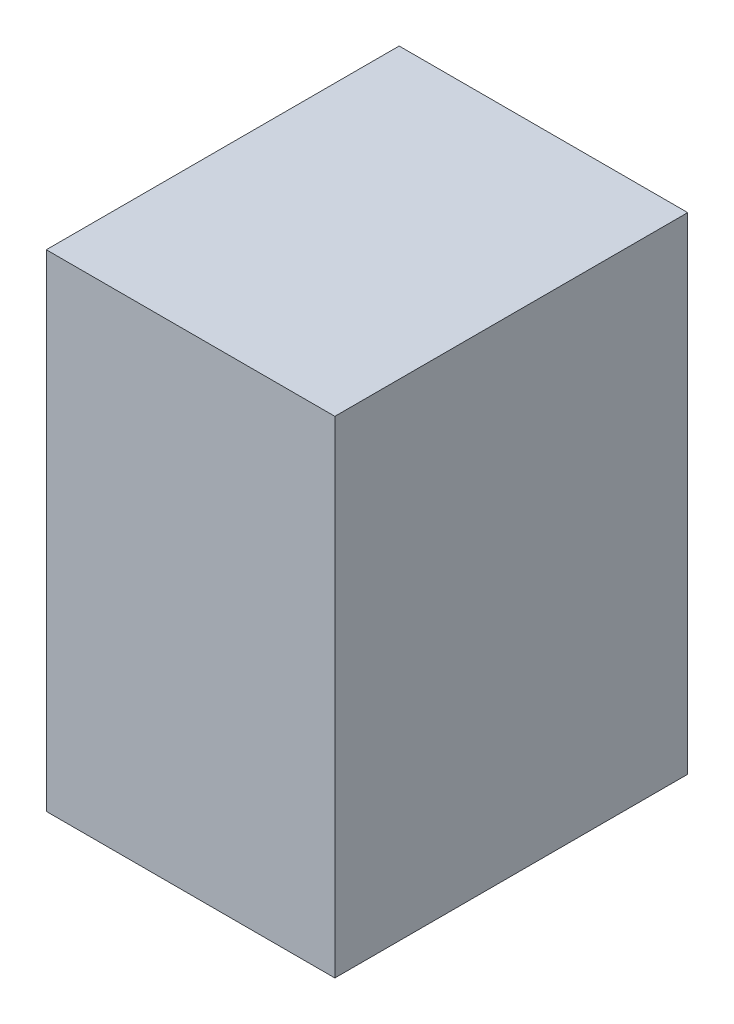
ISO-10303-21;
HEADER;
FILE_DESCRIPTION(('STEP AP214'),'2;1');
FILE_NAME('part.step','',(''),(''),'','','');
FILE_SCHEMA(('AUTOMOTIVE_DESIGN { 1 0 10303 214 1 1 1 1 }'));
ENDSEC;
DATA;
#1=APPLICATION_CONTEXT('core data for automotive mechanical design processes');
#2=APPLICATION_PROTOCOL_DEFINITION('international standard','automotive_design',2000,#1);
#3=PRODUCT_CONTEXT('',#1,'mechanical');
#4=PRODUCT('Part','Part','',(#3));
#5=PRODUCT_RELATED_PRODUCT_CATEGORY('part','',(#4));
#6=PRODUCT_DEFINITION_FORMATION('','',#4);
#7=PRODUCT_DEFINITION_CONTEXT('part definition',#1,'design');
#8=PRODUCT_DEFINITION('design','',#6,#7);
#9=PRODUCT_DEFINITION_SHAPE('','',#8);
#10=(LENGTH_UNIT() NAMED_UNIT(*) SI_UNIT(.MILLI.,.METRE.));
#11=(NAMED_UNIT(*) PLANE_ANGLE_UNIT() SI_UNIT($,.RADIAN.));
#12=(NAMED_UNIT(*) SI_UNIT($,.STERADIAN.) SOLID_ANGLE_UNIT());
#13=UNCERTAINTY_MEASURE_WITH_UNIT(LENGTH_MEASURE(1.E-05),#10,'distance_accuracy_value','');
#14=(GEOMETRIC_REPRESENTATION_CONTEXT(3) GLOBAL_UNCERTAINTY_ASSIGNED_CONTEXT((#13)) GLOBAL_UNIT_ASSIGNED_CONTEXT((#10,
#11,#12)) REPRESENTATION_CONTEXT('',''));
#15=CARTESIAN_POINT('',(0.,0.,0.));
#16=DIRECTION('',(0.,0.,1.));
#17=DIRECTION('',(1.,0.,0.));
#18=AXIS2_PLACEMENT_3D('',#15,#16,#17);
#19=CARTESIAN_POINT('',(-4.445,-7.493,0.));
#20=DIRECTION('',(-1.,0.,0.));
#21=DIRECTION('',(0.,0.,1.));
#22=AXIS2_PLACEMENT_3D('',#19,#20,#21);
#23=PLANE('',#22);
#24=DIRECTION('',(0.,0.,1.));
#25=VECTOR('',#24,1.);
#26=CARTESIAN_POINT('',(-4.445,7.493,0.));
#27=LINE('',#26,#25);
#28=CARTESIAN_POINT('',(-4.445,7.493,0.));
#29=VERTEX_POINT('',#28);
#30=CARTESIAN_POINT('',(-4.445,7.493,10.8712));
#31=VERTEX_POINT('',#30);
#32=EDGE_CURVE('E20',#29,#31,#27,.T.);
#33=ORIENTED_EDGE('',*,*,#32,.F.);
#34=DIRECTION('',(0.,1.,0.));
#35=VECTOR('',#34,1.);
#36=CARTESIAN_POINT('',(-4.445,7.493,0.));
#37=LINE('',#36,#35);
#38=CARTESIAN_POINT('',(-4.445,-7.493,0.));
#39=VERTEX_POINT('',#38);
#40=EDGE_CURVE('E79',#29,#39,#37,.F.);
#41=ORIENTED_EDGE('',*,*,#40,.T.);
#42=DIRECTION('',(0.,0.,-1.));
#43=VECTOR('',#42,1.);
#44=CARTESIAN_POINT('',(-4.445,-7.493,0.));
#45=LINE('',#44,#43);
#46=CARTESIAN_POINT('',(-4.445,-7.493,10.8712));
#47=VERTEX_POINT('',#46);
#48=EDGE_CURVE('E61',#47,#39,#45,.T.);
#49=ORIENTED_EDGE('',*,*,#48,.F.);
#50=DIRECTION('',(0.,1.,0.));
#51=VECTOR('',#50,1.);
#52=CARTESIAN_POINT('',(-4.445,7.493,10.8712));
#53=LINE('',#52,#51);
#54=EDGE_CURVE('E56',#31,#47,#53,.F.);
#55=ORIENTED_EDGE('',*,*,#54,.F.);
#56=EDGE_LOOP('',(#33,#41,#49,#55));
#57=FACE_BOUND('',#56,.T.);
#58=ADVANCED_FACE('F17',(#57),#23,.T.);
#59=CARTESIAN_POINT('',(-4.445,7.493,0.));
#60=DIRECTION('',(0.,1.,0.));
#61=DIRECTION('',(0.,0.,1.));
#62=AXIS2_PLACEMENT_3D('',#59,#60,#61);
#63=PLANE('',#62);
#64=DIRECTION('',(0.,0.,-1.));
#65=VECTOR('',#64,1.);
#66=CARTESIAN_POINT('',(4.445,7.493,0.));
#67=LINE('',#66,#65);
#68=CARTESIAN_POINT('',(4.445,7.493,0.));
#69=VERTEX_POINT('',#68);
#70=CARTESIAN_POINT('',(4.445,7.493,10.8712));
#71=VERTEX_POINT('',#70);
#72=EDGE_CURVE('E83',#69,#71,#67,.F.);
#73=ORIENTED_EDGE('',*,*,#72,.F.);
#74=DIRECTION('',(1.,0.,0.));
#75=VECTOR('',#74,1.);
#76=CARTESIAN_POINT('',(-4.445,7.493,0.));
#77=LINE('',#76,#75);
#78=EDGE_CURVE('E68',#69,#29,#77,.F.);
#79=ORIENTED_EDGE('',*,*,#78,.T.);
#80=ORIENTED_EDGE('',*,*,#32,.T.);
#81=DIRECTION('',(1.,0.,0.));
#82=VECTOR('',#81,1.);
#83=CARTESIAN_POINT('',(-4.445,7.493,10.8712));
#84=LINE('',#83,#82);
#85=EDGE_CURVE('E63',#71,#31,#84,.F.);
#86=ORIENTED_EDGE('',*,*,#85,.F.);
#87=EDGE_LOOP('',(#73,#79,#80,#86));
#88=FACE_BOUND('',#87,.T.);
#89=ADVANCED_FACE('F65',(#88),#63,.T.);
#90=CARTESIAN_POINT('',(-4.445,7.493,10.8712));
#91=DIRECTION('',(0.,0.,1.));
#92=DIRECTION('',(1.,0.,0.));
#93=AXIS2_PLACEMENT_3D('',#90,#91,#92);
#94=PLANE('',#93);
#95=DIRECTION('',(0.,1.,0.));
#96=VECTOR('',#95,1.);
#97=CARTESIAN_POINT('',(4.445,7.493,10.8712));
#98=LINE('',#97,#96);
#99=CARTESIAN_POINT('',(4.445,-7.493,10.8712));
#100=VERTEX_POINT('',#99);
#101=EDGE_CURVE('E72',#71,#100,#98,.F.);
#102=ORIENTED_EDGE('',*,*,#101,.F.);
#103=ORIENTED_EDGE('',*,*,#85,.T.);
#104=ORIENTED_EDGE('',*,*,#54,.T.);
#105=DIRECTION('',(1.,0.,0.));
#106=VECTOR('',#105,1.);
#107=CARTESIAN_POINT('',(4.445,-7.493,10.8712));
#108=LINE('',#107,#106);
#109=EDGE_CURVE('E74',#100,#47,#108,.F.);
#110=ORIENTED_EDGE('',*,*,#109,.F.);
#111=EDGE_LOOP('',(#102,#103,#104,#110));
#112=FACE_BOUND('',#111,.T.);
#113=ADVANCED_FACE('F70',(#112),#94,.T.);
#114=CARTESIAN_POINT('',(4.445,-7.493,0.));
#115=DIRECTION('',(0.,-1.,0.));
#116=DIRECTION('',(0.,0.,-1.));
#117=AXIS2_PLACEMENT_3D('',#114,#115,#116);
#118=PLANE('',#117);
#119=ORIENTED_EDGE('',*,*,#48,.T.);
#120=DIRECTION('',(1.,0.,0.));
#121=VECTOR('',#120,1.);
#122=CARTESIAN_POINT('',(-4.445,-7.493,0.));
#123=LINE('',#122,#121);
#124=CARTESIAN_POINT('',(4.445,-7.493,0.));
#125=VERTEX_POINT('',#124);
#126=EDGE_CURVE('E35',#39,#125,#123,.T.);
#127=ORIENTED_EDGE('',*,*,#126,.T.);
#128=DIRECTION('',(0.,0.,-1.));
#129=VECTOR('',#128,1.);
#130=CARTESIAN_POINT('',(4.445,-7.493,0.));
#131=LINE('',#130,#129);
#132=EDGE_CURVE('E26',#100,#125,#131,.T.);
#133=ORIENTED_EDGE('',*,*,#132,.F.);
#134=ORIENTED_EDGE('',*,*,#109,.T.);
#135=EDGE_LOOP('',(#119,#127,#133,#134));
#136=FACE_BOUND('',#135,.T.);
#137=ADVANCED_FACE('F89',(#136),#118,.T.);
#138=CARTESIAN_POINT('',(-4.445,7.493,0.));
#139=DIRECTION('',(0.,0.,1.));
#140=DIRECTION('',(1.,0.,0.));
#141=AXIS2_PLACEMENT_3D('',#138,#139,#140);
#142=PLANE('',#141);
#143=DIRECTION('',(0.,1.,0.));
#144=VECTOR('',#143,1.);
#145=CARTESIAN_POINT('',(4.445,7.493,0.));
#146=LINE('',#145,#144);
#147=EDGE_CURVE('E11',#125,#69,#146,.T.);
#148=ORIENTED_EDGE('',*,*,#147,.F.);
#149=ORIENTED_EDGE('',*,*,#126,.F.);
#150=ORIENTED_EDGE('',*,*,#40,.F.);
#151=ORIENTED_EDGE('',*,*,#78,.F.);
#152=EDGE_LOOP('',(#148,#149,#150,#151));
#153=FACE_BOUND('',#152,.T.);
#154=ADVANCED_FACE('F91',(#153),#142,.F.);
#155=CARTESIAN_POINT('',(4.445,7.493,0.));
#156=DIRECTION('',(1.,0.,0.));
#157=DIRECTION('',(0.,0.,-1.));
#158=AXIS2_PLACEMENT_3D('',#155,#156,#157);
#159=PLANE('',#158);
#160=ORIENTED_EDGE('',*,*,#132,.T.);
#161=ORIENTED_EDGE('',*,*,#147,.T.);
#162=ORIENTED_EDGE('',*,*,#72,.T.);
#163=ORIENTED_EDGE('',*,*,#101,.T.);
#164=EDGE_LOOP('',(#160,#161,#162,#163));
#165=FACE_BOUND('',#164,.T.);
#166=ADVANCED_FACE('F88',(#165),#159,.T.);
#167=CLOSED_SHELL('',(#58,#89,#113,#137,#154,#166));
#168=MANIFOLD_SOLID_BREP('B1',#167);
#169=ADVANCED_BREP_SHAPE_REPRESENTATION('',(#18,#168),#14);
#170=SHAPE_DEFINITION_REPRESENTATION(#9,#169);
ENDSEC;
END-ISO-10303-21;
